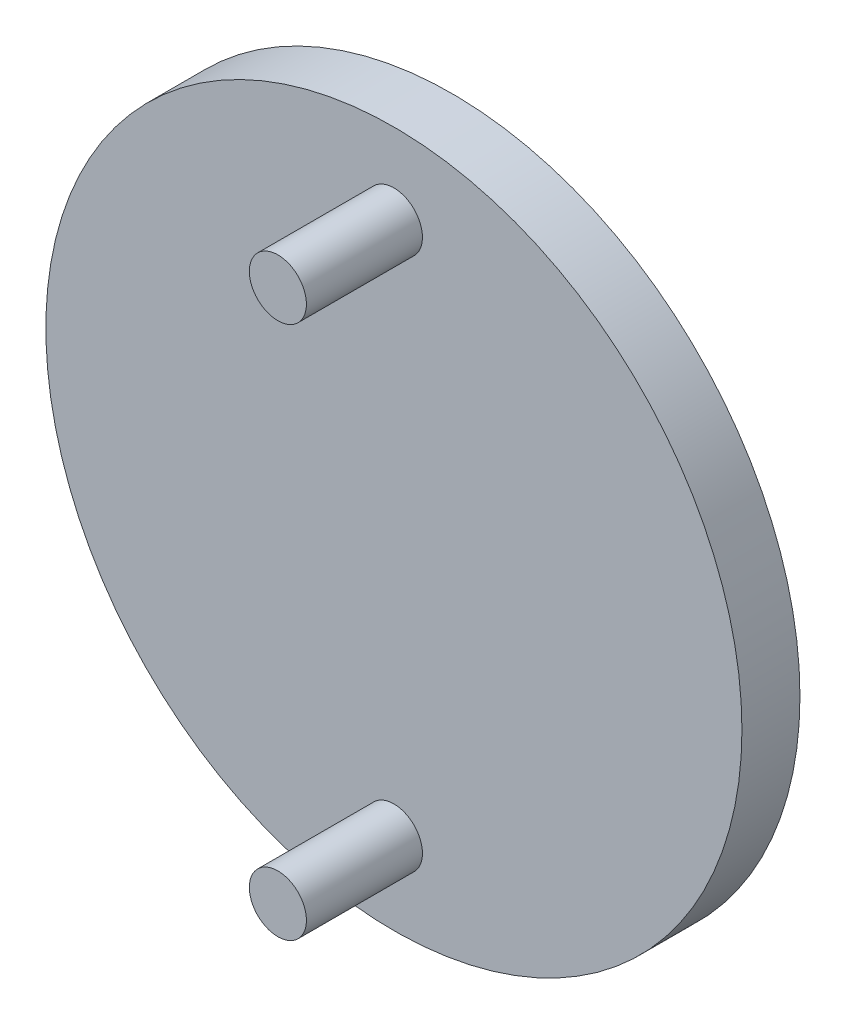
ISO-10303-21;
HEADER;
FILE_DESCRIPTION(('STEP AP214'),'2;1');
FILE_NAME('part.step','',(''),(''),'','','');
FILE_SCHEMA(('AUTOMOTIVE_DESIGN { 1 0 10303 214 1 1 1 1 }'));
ENDSEC;
DATA;
#1=APPLICATION_CONTEXT('core data for automotive mechanical design processes');
#2=APPLICATION_PROTOCOL_DEFINITION('international standard','automotive_design',2000,#1);
#3=PRODUCT_CONTEXT('',#1,'mechanical');
#4=PRODUCT('Part','Part','',(#3));
#5=PRODUCT_RELATED_PRODUCT_CATEGORY('part','',(#4));
#6=PRODUCT_DEFINITION_FORMATION('','',#4);
#7=PRODUCT_DEFINITION_CONTEXT('part definition',#1,'design');
#8=PRODUCT_DEFINITION('design','',#6,#7);
#9=PRODUCT_DEFINITION_SHAPE('','',#8);
#10=(LENGTH_UNIT() NAMED_UNIT(*) SI_UNIT(.MILLI.,.METRE.));
#11=(NAMED_UNIT(*) PLANE_ANGLE_UNIT() SI_UNIT($,.RADIAN.));
#12=(NAMED_UNIT(*) SI_UNIT($,.STERADIAN.) SOLID_ANGLE_UNIT());
#13=UNCERTAINTY_MEASURE_WITH_UNIT(LENGTH_MEASURE(1.E-05),#10,'distance_accuracy_value','');
#14=(GEOMETRIC_REPRESENTATION_CONTEXT(3) GLOBAL_UNCERTAINTY_ASSIGNED_CONTEXT((#13)) GLOBAL_UNIT_ASSIGNED_CONTEXT((#10,
#11,#12)) REPRESENTATION_CONTEXT('',''));
#15=CARTESIAN_POINT('',(0.,0.,0.));
#16=DIRECTION('',(0.,0.,1.));
#17=DIRECTION('',(1.,0.,0.));
#18=AXIS2_PLACEMENT_3D('',#15,#16,#17);
#19=CARTESIAN_POINT('',(0.,0.,10.));
#20=DIRECTION('',(0.,0.,-1.));
#21=DIRECTION('',(-1.,0.,0.));
#22=AXIS2_PLACEMENT_3D('',#19,#20,#21);
#23=CYLINDRICAL_SURFACE('',#22,60.);
#24=CARTESIAN_POINT('',(0.,0.,10.));
#25=DIRECTION('',(0.,0.,1.));
#26=DIRECTION('',(1.,0.,0.));
#27=AXIS2_PLACEMENT_3D('',#24,#25,#26);
#28=CIRCLE('',#27,60.);
#29=CARTESIAN_POINT('',(60.,0.,10.));
#30=VERTEX_POINT('',#29);
#31=EDGE_CURVE('E10',#30,#30,#28,.T.);
#32=ORIENTED_EDGE('',*,*,#31,.F.);
#33=EDGE_LOOP('',(#32));
#34=FACE_BOUND('',#33,.T.);
#35=CARTESIAN_POINT('',(0.,0.,0.));
#36=DIRECTION('',(0.,0.,1.));
#37=DIRECTION('',(1.,0.,0.));
#38=AXIS2_PLACEMENT_3D('',#35,#36,#37);
#39=CIRCLE('',#38,60.);
#40=CARTESIAN_POINT('',(60.,0.,0.));
#41=VERTEX_POINT('',#40);
#42=EDGE_CURVE('E40',#41,#41,#39,.T.);
#43=ORIENTED_EDGE('',*,*,#42,.T.);
#44=EDGE_LOOP('',(#43));
#45=FACE_BOUND('',#44,.T.);
#46=ADVANCED_FACE('F37',(#34,#45),#23,.T.);
#47=CARTESIAN_POINT('',(0.,0.,10.));
#48=DIRECTION('',(0.,0.,1.));
#49=DIRECTION('',(1.,0.,0.));
#50=AXIS2_PLACEMENT_3D('',#47,#48,#49);
#51=PLANE('',#50);
#52=CARTESIAN_POINT('',(0.,-45.984931591729,10.));
#53=DIRECTION('',(0.,0.,1.));
#54=DIRECTION('',(1.,0.,0.));
#55=AXIS2_PLACEMENT_3D('',#52,#53,#54);
#56=CIRCLE('',#55,4.92);
#57=CARTESIAN_POINT('',(4.92,-45.984931591729,10.));
#58=VERTEX_POINT('',#57);
#59=EDGE_CURVE('E58',#58,#58,#56,.F.);
#60=ORIENTED_EDGE('',*,*,#59,.T.);
#61=EDGE_LOOP('',(#60));
#62=FACE_BOUND('',#61,.T.);
#63=CARTESIAN_POINT('',(0.,45.984931591729,10.));
#64=DIRECTION('',(0.,0.,1.));
#65=DIRECTION('',(1.,0.,0.));
#66=AXIS2_PLACEMENT_3D('',#63,#64,#65);
#67=CIRCLE('',#66,4.92);
#68=CARTESIAN_POINT('',(4.92,45.984931591729,10.));
#69=VERTEX_POINT('',#68);
#70=EDGE_CURVE('E49',#69,#69,#67,.F.);
#71=ORIENTED_EDGE('',*,*,#70,.T.);
#72=EDGE_LOOP('',(#71));
#73=FACE_BOUND('',#72,.T.);
#74=ORIENTED_EDGE('',*,*,#31,.T.);
#75=EDGE_LOOP('',(#74));
#76=FACE_BOUND('',#75,.T.);
#77=ADVANCED_FACE('F84',(#62,#73,#76),#51,.T.);
#78=CARTESIAN_POINT('',(0.,0.,0.));
#79=DIRECTION('',(0.,0.,1.));
#80=DIRECTION('',(1.,0.,0.));
#81=AXIS2_PLACEMENT_3D('',#78,#79,#80);
#82=PLANE('',#81);
#83=ORIENTED_EDGE('',*,*,#42,.F.);
#84=EDGE_LOOP('',(#83));
#85=FACE_BOUND('',#84,.T.);
#86=ADVANCED_FACE('F89',(#85),#82,.F.);
#87=CARTESIAN_POINT('',(0.,45.984931591729,30.));
#88=DIRECTION('',(0.,0.,-1.));
#89=DIRECTION('',(-1.,0.,0.));
#90=AXIS2_PLACEMENT_3D('',#87,#88,#89);
#91=CYLINDRICAL_SURFACE('',#90,4.92);
#92=ORIENTED_EDGE('',*,*,#70,.F.);
#93=EDGE_LOOP('',(#92));
#94=FACE_BOUND('',#93,.T.);
#95=CARTESIAN_POINT('',(0.,45.984931591729,30.));
#96=DIRECTION('',(0.,0.,1.));
#97=DIRECTION('',(1.,0.,0.));
#98=AXIS2_PLACEMENT_3D('',#95,#96,#97);
#99=CIRCLE('',#98,4.92);
#100=CARTESIAN_POINT('',(4.92,45.984931591729,30.));
#101=VERTEX_POINT('',#100);
#102=EDGE_CURVE('E54',#101,#101,#99,.T.);
#103=ORIENTED_EDGE('',*,*,#102,.F.);
#104=EDGE_LOOP('',(#103));
#105=FACE_BOUND('',#104,.T.);
#106=ADVANCED_FACE('F79',(#94,#105),#91,.T.);
#107=CARTESIAN_POINT('',(0.,45.984931591729,30.));
#108=DIRECTION('',(0.,0.,1.));
#109=DIRECTION('',(1.,0.,0.));
#110=AXIS2_PLACEMENT_3D('',#107,#108,#109);
#111=PLANE('',#110);
#112=ORIENTED_EDGE('',*,*,#102,.T.);
#113=EDGE_LOOP('',(#112));
#114=FACE_BOUND('',#113,.T.);
#115=ADVANCED_FACE('F71',(#114),#111,.T.);
#116=CARTESIAN_POINT('',(0.,-45.984931591729,30.));
#117=DIRECTION('',(0.,0.,-1.));
#118=DIRECTION('',(-1.,0.,0.));
#119=AXIS2_PLACEMENT_3D('',#116,#117,#118);
#120=CYLINDRICAL_SURFACE('',#119,4.92);
#121=ORIENTED_EDGE('',*,*,#59,.F.);
#122=EDGE_LOOP('',(#121));
#123=FACE_BOUND('',#122,.T.);
#124=CARTESIAN_POINT('',(0.,-45.984931591729,30.));
#125=DIRECTION('',(0.,0.,1.));
#126=DIRECTION('',(-1.,0.,0.));
#127=AXIS2_PLACEMENT_3D('',#124,#125,#126);
#128=CIRCLE('',#127,4.92);
#129=CARTESIAN_POINT('',(-4.92,-45.984931591729,30.));
#130=VERTEX_POINT('',#129);
#131=EDGE_CURVE('E62',#130,#130,#128,.T.);
#132=ORIENTED_EDGE('',*,*,#131,.F.);
#133=EDGE_LOOP('',(#132));
#134=FACE_BOUND('',#133,.T.);
#135=ADVANCED_FACE('F69',(#123,#134),#120,.T.);
#136=CARTESIAN_POINT('',(0.,-45.984931591729,30.));
#137=DIRECTION('',(0.,0.,1.));
#138=DIRECTION('',(-1.,0.,0.));
#139=AXIS2_PLACEMENT_3D('',#136,#137,#138);
#140=PLANE('',#139);
#141=ORIENTED_EDGE('',*,*,#131,.T.);
#142=EDGE_LOOP('',(#141));
#143=FACE_BOUND('',#142,.T.);
#144=ADVANCED_FACE('F67',(#143),#140,.T.);
#145=CLOSED_SHELL('',(#46,#77,#86,#106,#115,#135,#144));
#146=MANIFOLD_SOLID_BREP('B2',#145);
#147=ADVANCED_BREP_SHAPE_REPRESENTATION('',(#18,#146),#14);
#148=SHAPE_DEFINITION_REPRESENTATION(#9,#147);
ENDSEC;
END-ISO-10303-21;
